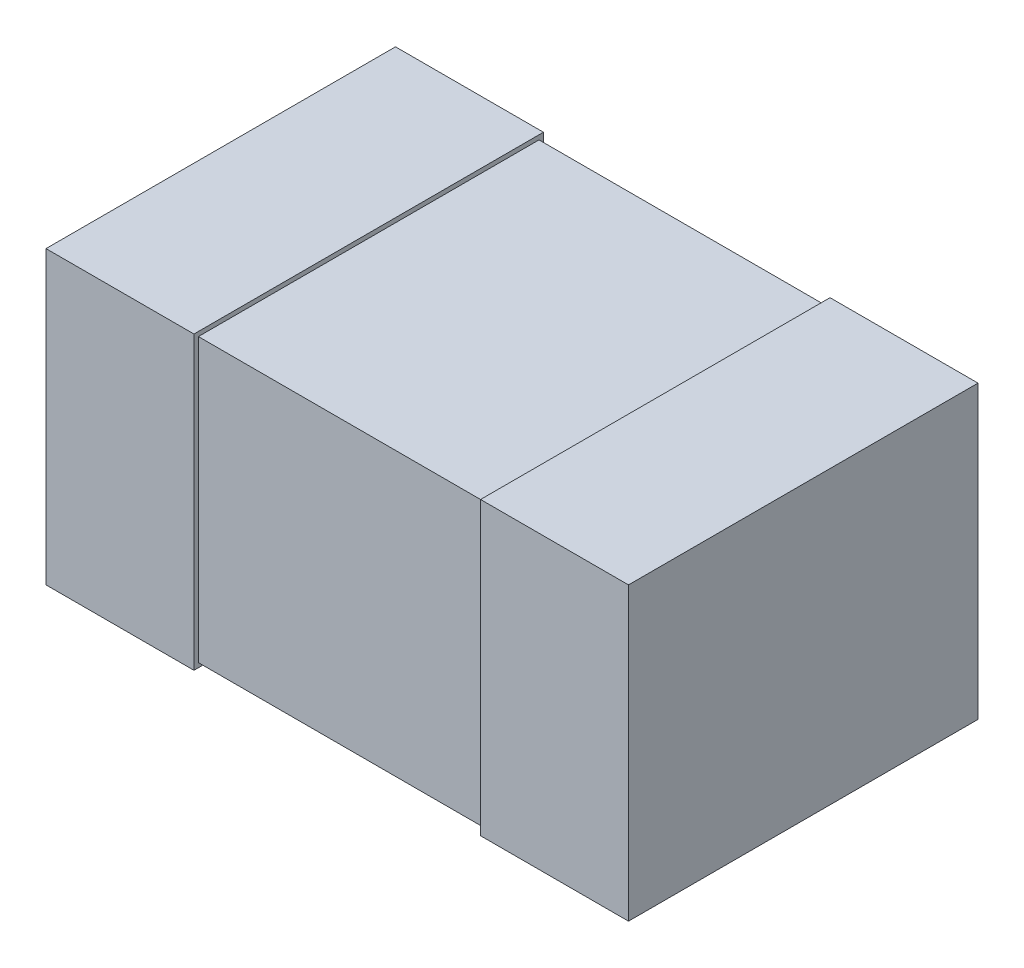
ISO-10303-21;
HEADER;
FILE_DESCRIPTION(('STEP AP214'),'2;1');
FILE_NAME('part.step','',(''),(''),'','','');
FILE_SCHEMA(('AUTOMOTIVE_DESIGN { 1 0 10303 214 1 1 1 1 }'));
ENDSEC;
DATA;
#1=APPLICATION_CONTEXT('core data for automotive mechanical design processes');
#2=APPLICATION_PROTOCOL_DEFINITION('international standard','automotive_design',2000,#1);
#3=PRODUCT_CONTEXT('',#1,'mechanical');
#4=PRODUCT('Part','Part','',(#3));
#5=PRODUCT_RELATED_PRODUCT_CATEGORY('part','',(#4));
#6=PRODUCT_DEFINITION_FORMATION('','',#4);
#7=PRODUCT_DEFINITION_CONTEXT('part definition',#1,'design');
#8=PRODUCT_DEFINITION('design','',#6,#7);
#9=PRODUCT_DEFINITION_SHAPE('','',#8);
#10=(LENGTH_UNIT() NAMED_UNIT(*) SI_UNIT(.MILLI.,.METRE.));
#11=(NAMED_UNIT(*) PLANE_ANGLE_UNIT() SI_UNIT($,.RADIAN.));
#12=(NAMED_UNIT(*) SI_UNIT($,.STERADIAN.) SOLID_ANGLE_UNIT());
#13=UNCERTAINTY_MEASURE_WITH_UNIT(LENGTH_MEASURE(1.E-05),#10,'distance_accuracy_value','');
#14=(GEOMETRIC_REPRESENTATION_CONTEXT(3) GLOBAL_UNCERTAINTY_ASSIGNED_CONTEXT((#13)) GLOBAL_UNIT_ASSIGNED_CONTEXT((#10,
#11,#12)) REPRESENTATION_CONTEXT('',''));
#15=CARTESIAN_POINT('',(0.,0.,0.));
#16=DIRECTION('',(0.,0.,1.));
#17=DIRECTION('',(1.,0.,0.));
#18=AXIS2_PLACEMENT_3D('',#15,#16,#17);
#19=CARTESIAN_POINT('',(0.5,-0.25,0.0762));
#20=DIRECTION('',(1.,0.,0.));
#21=DIRECTION('',(0.,0.,-1.));
#22=AXIS2_PLACEMENT_3D('',#19,#20,#21);
#23=PLANE('',#22);
#24=DIRECTION('',(0.,0.,-1.));
#25=VECTOR('',#24,1.);
#26=CARTESIAN_POINT('',(0.5,-0.25,0.0762));
#27=LINE('',#26,#25);
#28=CARTESIAN_POINT('',(0.5,-0.25,0.0762));
#29=VERTEX_POINT('',#28);
#30=CARTESIAN_POINT('',(0.5,-0.25,0.6762));
#31=VERTEX_POINT('',#30);
#32=EDGE_CURVE('E109',#29,#31,#27,.F.);
#33=ORIENTED_EDGE('',*,*,#32,.F.);
#34=DIRECTION('',(0.,1.,0.));
#35=VECTOR('',#34,1.);
#36=CARTESIAN_POINT('',(0.5,0.,0.0762));
#37=LINE('',#36,#35);
#38=CARTESIAN_POINT('',(0.5,0.25,0.0762));
#39=VERTEX_POINT('',#38);
#40=EDGE_CURVE('E20',#29,#39,#37,.T.);
#41=ORIENTED_EDGE('',*,*,#40,.T.);
#42=DIRECTION('',(0.,0.,1.));
#43=VECTOR('',#42,1.);
#44=CARTESIAN_POINT('',(0.5,0.25,0.0762));
#45=LINE('',#44,#43);
#46=CARTESIAN_POINT('',(0.5,0.25,0.6762));
#47=VERTEX_POINT('',#46);
#48=EDGE_CURVE('E104',#47,#39,#45,.F.);
#49=ORIENTED_EDGE('',*,*,#48,.F.);
#50=DIRECTION('',(0.,1.,0.));
#51=VECTOR('',#50,1.);
#52=CARTESIAN_POINT('',(0.5,0.,0.6762));
#53=LINE('',#52,#51);
#54=EDGE_CURVE('E119',#31,#47,#53,.T.);
#55=ORIENTED_EDGE('',*,*,#54,.F.);
#56=EDGE_LOOP('',(#33,#41,#49,#55));
#57=FACE_BOUND('',#56,.T.);
#58=ADVANCED_FACE('F17',(#57),#23,.T.);
#59=CARTESIAN_POINT('',(0.,0.,0.0762));
#60=DIRECTION('',(0.,0.,1.));
#61=DIRECTION('',(1.,0.,0.));
#62=AXIS2_PLACEMENT_3D('',#59,#60,#61);
#63=PLANE('',#62);
#64=ORIENTED_EDGE('',*,*,#40,.F.);
#65=DIRECTION('',(1.,0.,0.));
#66=VECTOR('',#65,1.);
#67=CARTESIAN_POINT('',(-0.5,-0.25,0.0762));
#68=LINE('',#67,#66);
#69=CARTESIAN_POINT('',(0.246,-0.25,0.0762));
#70=VERTEX_POINT('',#69);
#71=EDGE_CURVE('E128',#70,#29,#68,.T.);
#72=ORIENTED_EDGE('',*,*,#71,.F.);
#73=DIRECTION('',(0.,1.,0.));
#74=VECTOR('',#73,1.);
#75=CARTESIAN_POINT('',(0.246,-0.25,0.0762));
#76=LINE('',#75,#74);
#77=CARTESIAN_POINT('',(0.246,0.25,0.0762));
#78=VERTEX_POINT('',#77);
#79=EDGE_CURVE('E116',#70,#78,#76,.T.);
#80=ORIENTED_EDGE('',*,*,#79,.T.);
#81=DIRECTION('',(1.,0.,0.));
#82=VECTOR('',#81,1.);
#83=CARTESIAN_POINT('',(0.5,0.25,0.0762));
#84=LINE('',#83,#82);
#85=EDGE_CURVE('E113',#39,#78,#84,.F.);
#86=ORIENTED_EDGE('',*,*,#85,.F.);
#87=EDGE_LOOP('',(#64,#72,#80,#86));
#88=FACE_BOUND('',#87,.T.);
#89=ADVANCED_FACE('F114',(#88),#63,.F.);
#90=CARTESIAN_POINT('',(0.5,0.25,0.0762));
#91=DIRECTION('',(0.,1.,0.));
#92=DIRECTION('',(0.,0.,1.));
#93=AXIS2_PLACEMENT_3D('',#90,#91,#92);
#94=PLANE('',#93);
#95=ORIENTED_EDGE('',*,*,#85,.T.);
#96=DIRECTION('',(0.,0.,-1.));
#97=VECTOR('',#96,1.);
#98=CARTESIAN_POINT('',(0.246,0.25,0.08382));
#99=LINE('',#98,#97);
#100=CARTESIAN_POINT('',(0.246,0.25,0.6762));
#101=VERTEX_POINT('',#100);
#102=EDGE_CURVE('E135',#78,#101,#99,.F.);
#103=ORIENTED_EDGE('',*,*,#102,.T.);
#104=DIRECTION('',(1.,0.,0.));
#105=VECTOR('',#104,1.);
#106=CARTESIAN_POINT('',(0.,0.25,0.6762));
#107=LINE('',#106,#105);
#108=EDGE_CURVE('E123',#47,#101,#107,.F.);
#109=ORIENTED_EDGE('',*,*,#108,.F.);
#110=ORIENTED_EDGE('',*,*,#48,.T.);
#111=EDGE_LOOP('',(#95,#103,#109,#110));
#112=FACE_BOUND('',#111,.T.);
#113=ADVANCED_FACE('F121',(#112),#94,.T.);
#114=CARTESIAN_POINT('',(0.,0.,0.6762));
#115=DIRECTION('',(0.,0.,1.));
#116=DIRECTION('',(1.,0.,0.));
#117=AXIS2_PLACEMENT_3D('',#114,#115,#116);
#118=PLANE('',#117);
#119=ORIENTED_EDGE('',*,*,#108,.T.);
#120=DIRECTION('',(0.,1.,0.));
#121=VECTOR('',#120,1.);
#122=CARTESIAN_POINT('',(0.246,-0.25,0.6762));
#123=LINE('',#122,#121);
#124=CARTESIAN_POINT('',(0.246,-0.25,0.6762));
#125=VERTEX_POINT('',#124);
#126=EDGE_CURVE('E137',#101,#125,#123,.F.);
#127=ORIENTED_EDGE('',*,*,#126,.T.);
#128=DIRECTION('',(1.,0.,0.));
#129=VECTOR('',#128,1.);
#130=CARTESIAN_POINT('',(-0.5,-0.25,0.6762));
#131=LINE('',#130,#129);
#132=EDGE_CURVE('E131',#31,#125,#131,.F.);
#133=ORIENTED_EDGE('',*,*,#132,.F.);
#134=ORIENTED_EDGE('',*,*,#54,.T.);
#135=EDGE_LOOP('',(#119,#127,#133,#134));
#136=FACE_BOUND('',#135,.T.);
#137=ADVANCED_FACE('F327',(#136),#118,.T.);
#138=CARTESIAN_POINT('',(-0.5,-0.25,0.0762));
#139=DIRECTION('',(0.,-1.,0.));
#140=DIRECTION('',(0.,0.,-1.));
#141=AXIS2_PLACEMENT_3D('',#138,#139,#140);
#142=PLANE('',#141);
#143=ORIENTED_EDGE('',*,*,#132,.T.);
#144=DIRECTION('',(0.,0.,-1.));
#145=VECTOR('',#144,1.);
#146=CARTESIAN_POINT('',(0.246,-0.25,0.08382));
#147=LINE('',#146,#145);
#148=EDGE_CURVE('E139',#125,#70,#147,.T.);
#149=ORIENTED_EDGE('',*,*,#148,.T.);
#150=ORIENTED_EDGE('',*,*,#71,.T.);
#151=ORIENTED_EDGE('',*,*,#32,.T.);
#152=EDGE_LOOP('',(#143,#149,#150,#151));
#153=FACE_BOUND('',#152,.T.);
#154=ADVANCED_FACE('F318',(#153),#142,.T.);
#155=CARTESIAN_POINT('',(0.246,-0.25,0.08382));
#156=DIRECTION('',(1.,0.,0.));
#157=DIRECTION('',(0.,0.,-1.));
#158=AXIS2_PLACEMENT_3D('',#155,#156,#157);
#159=PLANE('',#158);
#160=DIRECTION('',(0.,1.,0.));
#161=VECTOR('',#160,1.);
#162=CARTESIAN_POINT('',(0.246,0.25,0.66858));
#163=LINE('',#162,#161);
#164=CARTESIAN_POINT('',(0.246,0.24238,0.66858));
#165=VERTEX_POINT('',#164);
#166=CARTESIAN_POINT('',(0.246,-0.24238,0.66858));
#167=VERTEX_POINT('',#166);
#168=EDGE_CURVE('E157',#165,#167,#163,.F.);
#169=ORIENTED_EDGE('',*,*,#168,.T.);
#170=DIRECTION('',(0.,0.,1.));
#171=VECTOR('',#170,1.);
#172=CARTESIAN_POINT('',(0.246,-0.24238,0.6762));
#173=LINE('',#172,#171);
#174=CARTESIAN_POINT('',(0.246,-0.24238,0.08382));
#175=VERTEX_POINT('',#174);
#176=EDGE_CURVE('E142',#167,#175,#173,.F.);
#177=ORIENTED_EDGE('',*,*,#176,.T.);
#178=DIRECTION('',(0.,1.,0.));
#179=VECTOR('',#178,1.);
#180=CARTESIAN_POINT('',(0.246,-0.25,0.08382));
#181=LINE('',#180,#179);
#182=CARTESIAN_POINT('',(0.246,0.24238,0.08382));
#183=VERTEX_POINT('',#182);
#184=EDGE_CURVE('E147',#175,#183,#181,.T.);
#185=ORIENTED_EDGE('',*,*,#184,.T.);
#186=DIRECTION('',(0.,0.,-1.));
#187=VECTOR('',#186,1.);
#188=CARTESIAN_POINT('',(0.246,0.24238,0.0762));
#189=LINE('',#188,#187);
#190=EDGE_CURVE('E152',#183,#165,#189,.F.);
#191=ORIENTED_EDGE('',*,*,#190,.T.);
#192=EDGE_LOOP('',(#169,#177,#185,#191));
#193=FACE_BOUND('',#192,.T.);
#194=ORIENTED_EDGE('',*,*,#126,.F.);
#195=ORIENTED_EDGE('',*,*,#102,.F.);
#196=ORIENTED_EDGE('',*,*,#79,.F.);
#197=ORIENTED_EDGE('',*,*,#148,.F.);
#198=EDGE_LOOP('',(#194,#195,#196,#197));
#199=FACE_BOUND('',#198,.T.);
#200=ADVANCED_FACE('F307',(#193,#199),#159,.F.);
#201=CARTESIAN_POINT('',(-0.246,-0.24238,0.6762));
#202=DIRECTION('',(0.,1.,0.));
#203=DIRECTION('',(0.,0.,1.));
#204=AXIS2_PLACEMENT_3D('',#201,#202,#203);
#205=PLANE('',#204);
#206=DIRECTION('',(1.,0.,0.));
#207=VECTOR('',#206,1.);
#208=CARTESIAN_POINT('',(-0.246,-0.24238,0.08382));
#209=LINE('',#208,#207);
#210=CARTESIAN_POINT('',(-0.246,-0.24238,0.08382));
#211=VERTEX_POINT('',#210);
#212=EDGE_CURVE('E144',#211,#175,#209,.T.);
#213=ORIENTED_EDGE('',*,*,#212,.T.);
#214=ORIENTED_EDGE('',*,*,#176,.F.);
#215=DIRECTION('',(-1.,0.,0.));
#216=VECTOR('',#215,1.);
#217=CARTESIAN_POINT('',(-0.246,-0.24238,0.66858));
#218=LINE('',#217,#216);
#219=CARTESIAN_POINT('',(-0.246,-0.24238,0.66858));
#220=VERTEX_POINT('',#219);
#221=EDGE_CURVE('E159',#167,#220,#218,.T.);
#222=ORIENTED_EDGE('',*,*,#221,.T.);
#223=DIRECTION('',(0.,0.,1.));
#224=VECTOR('',#223,1.);
#225=CARTESIAN_POINT('',(-0.246,-0.24238,0.0762));
#226=LINE('',#225,#224);
#227=EDGE_CURVE('E161',#220,#211,#226,.F.);
#228=ORIENTED_EDGE('',*,*,#227,.T.);
#229=EDGE_LOOP('',(#213,#214,#222,#228));
#230=FACE_BOUND('',#229,.T.);
#231=ADVANCED_FACE('F297',(#230),#205,.F.);
#232=CARTESIAN_POINT('',(-0.246,-0.25,0.08382));
#233=DIRECTION('',(0.,0.,1.));
#234=DIRECTION('',(1.,0.,0.));
#235=AXIS2_PLACEMENT_3D('',#232,#233,#234);
#236=PLANE('',#235);
#237=DIRECTION('',(1.,0.,0.));
#238=VECTOR('',#237,1.);
#239=CARTESIAN_POINT('',(-0.246,0.24238,0.08382));
#240=LINE('',#239,#238);
#241=CARTESIAN_POINT('',(-0.246,0.24238,0.08382));
#242=VERTEX_POINT('',#241);
#243=EDGE_CURVE('E149',#242,#183,#240,.T.);
#244=ORIENTED_EDGE('',*,*,#243,.T.);
#245=ORIENTED_EDGE('',*,*,#184,.F.);
#246=ORIENTED_EDGE('',*,*,#212,.F.);
#247=DIRECTION('',(0.,1.,0.));
#248=VECTOR('',#247,1.);
#249=CARTESIAN_POINT('',(-0.246,-0.25,0.08382));
#250=LINE('',#249,#248);
#251=EDGE_CURVE('E163',#211,#242,#250,.T.);
#252=ORIENTED_EDGE('',*,*,#251,.T.);
#253=EDGE_LOOP('',(#244,#245,#246,#252));
#254=FACE_BOUND('',#253,.T.);
#255=ADVANCED_FACE('F287',(#254),#236,.F.);
#256=CARTESIAN_POINT('',(-0.246,0.24238,0.0762));
#257=DIRECTION('',(0.,-1.,0.));
#258=DIRECTION('',(0.,0.,-1.));
#259=AXIS2_PLACEMENT_3D('',#256,#257,#258);
#260=PLANE('',#259);
#261=DIRECTION('',(-1.,0.,0.));
#262=VECTOR('',#261,1.);
#263=CARTESIAN_POINT('',(-0.246,0.24238,0.66858));
#264=LINE('',#263,#262);
#265=CARTESIAN_POINT('',(-0.246,0.24238,0.66858));
#266=VERTEX_POINT('',#265);
#267=EDGE_CURVE('E154',#266,#165,#264,.F.);
#268=ORIENTED_EDGE('',*,*,#267,.T.);
#269=ORIENTED_EDGE('',*,*,#190,.F.);
#270=ORIENTED_EDGE('',*,*,#243,.F.);
#271=DIRECTION('',(0.,0.,1.));
#272=VECTOR('',#271,1.);
#273=CARTESIAN_POINT('',(-0.246,0.24238,0.0762));
#274=LINE('',#273,#272);
#275=EDGE_CURVE('E165',#242,#266,#274,.T.);
#276=ORIENTED_EDGE('',*,*,#275,.T.);
#277=EDGE_LOOP('',(#268,#269,#270,#276));
#278=FACE_BOUND('',#277,.T.);
#279=ADVANCED_FACE('F278',(#278),#260,.F.);
#280=CARTESIAN_POINT('',(-0.246,0.25,0.66858));
#281=DIRECTION('',(0.,0.,-1.));
#282=DIRECTION('',(-1.,0.,0.));
#283=AXIS2_PLACEMENT_3D('',#280,#281,#282);
#284=PLANE('',#283);
#285=ORIENTED_EDGE('',*,*,#221,.F.);
#286=ORIENTED_EDGE('',*,*,#168,.F.);
#287=ORIENTED_EDGE('',*,*,#267,.F.);
#288=DIRECTION('',(0.,1.,0.));
#289=VECTOR('',#288,1.);
#290=CARTESIAN_POINT('',(-0.246,-0.25,0.66858));
#291=LINE('',#290,#289);
#292=EDGE_CURVE('E167',#266,#220,#291,.F.);
#293=ORIENTED_EDGE('',*,*,#292,.T.);
#294=EDGE_LOOP('',(#285,#286,#287,#293));
#295=FACE_BOUND('',#294,.T.);
#296=ADVANCED_FACE('F219',(#295),#284,.F.);
#297=CARTESIAN_POINT('',(-0.246,-0.25,0.0762));
#298=DIRECTION('',(-1.,0.,0.));
#299=DIRECTION('',(0.,0.,1.));
#300=AXIS2_PLACEMENT_3D('',#297,#298,#299);
#301=PLANE('',#300);
#302=ORIENTED_EDGE('',*,*,#275,.F.);
#303=ORIENTED_EDGE('',*,*,#251,.F.);
#304=ORIENTED_EDGE('',*,*,#227,.F.);
#305=ORIENTED_EDGE('',*,*,#292,.F.);
#306=EDGE_LOOP('',(#302,#303,#304,#305));
#307=FACE_BOUND('',#306,.T.);
#308=DIRECTION('',(0.,1.,0.));
#309=VECTOR('',#308,1.);
#310=CARTESIAN_POINT('',(-0.246,0.,0.6762));
#311=LINE('',#310,#309);
#312=CARTESIAN_POINT('',(-0.246,-0.25,0.6762));
#313=VERTEX_POINT('',#312);
#314=CARTESIAN_POINT('',(-0.246,0.25,0.6762));
#315=VERTEX_POINT('',#314);
#316=EDGE_CURVE('E175',#313,#315,#311,.T.);
#317=ORIENTED_EDGE('',*,*,#316,.F.);
#318=DIRECTION('',(0.,0.,-1.));
#319=VECTOR('',#318,1.);
#320=CARTESIAN_POINT('',(-0.246,-0.25,0.0762));
#321=LINE('',#320,#319);
#322=CARTESIAN_POINT('',(-0.246,-0.25,0.0762));
#323=VERTEX_POINT('',#322);
#324=EDGE_CURVE('E170',#323,#313,#321,.F.);
#325=ORIENTED_EDGE('',*,*,#324,.F.);
#326=DIRECTION('',(0.,1.,0.));
#327=VECTOR('',#326,1.);
#328=CARTESIAN_POINT('',(-0.246,0.,0.0762));
#329=LINE('',#328,#327);
#330=CARTESIAN_POINT('',(-0.246,0.25,0.0762));
#331=VERTEX_POINT('',#330);
#332=EDGE_CURVE('E182',#323,#331,#329,.T.);
#333=ORIENTED_EDGE('',*,*,#332,.T.);
#334=DIRECTION('',(0.,0.,1.));
#335=VECTOR('',#334,1.);
#336=CARTESIAN_POINT('',(-0.246,0.25,0.0762));
#337=LINE('',#336,#335);
#338=EDGE_CURVE('E180',#315,#331,#337,.F.);
#339=ORIENTED_EDGE('',*,*,#338,.F.);
#340=EDGE_LOOP('',(#317,#325,#333,#339));
#341=FACE_BOUND('',#340,.T.);
#342=ADVANCED_FACE('F204',(#307,#341),#301,.F.);
#343=CARTESIAN_POINT('',(-0.5,-0.25,0.0762));
#344=DIRECTION('',(0.,-1.,0.));
#345=DIRECTION('',(0.,0.,-1.));
#346=AXIS2_PLACEMENT_3D('',#343,#344,#345);
#347=PLANE('',#346);
#348=DIRECTION('',(1.,0.,0.));
#349=VECTOR('',#348,1.);
#350=CARTESIAN_POINT('',(0.,-0.25,0.0762));
#351=LINE('',#350,#349);
#352=CARTESIAN_POINT('',(-0.5,-0.25,0.0762));
#353=VERTEX_POINT('',#352);
#354=EDGE_CURVE('E185',#353,#323,#351,.T.);
#355=ORIENTED_EDGE('',*,*,#354,.T.);
#356=ORIENTED_EDGE('',*,*,#324,.T.);
#357=DIRECTION('',(1.,0.,0.));
#358=VECTOR('',#357,1.);
#359=CARTESIAN_POINT('',(0.,-0.25,0.6762));
#360=LINE('',#359,#358);
#361=CARTESIAN_POINT('',(-0.5,-0.25,0.6762));
#362=VERTEX_POINT('',#361);
#363=EDGE_CURVE('E172',#362,#313,#360,.T.);
#364=ORIENTED_EDGE('',*,*,#363,.F.);
#365=DIRECTION('',(0.,0.,1.));
#366=VECTOR('',#365,1.);
#367=CARTESIAN_POINT('',(-0.5,-0.25,0.0762));
#368=LINE('',#367,#366);
#369=EDGE_CURVE('E188',#353,#362,#368,.T.);
#370=ORIENTED_EDGE('',*,*,#369,.F.);
#371=EDGE_LOOP('',(#355,#356,#364,#370));
#372=FACE_BOUND('',#371,.T.);
#373=ADVANCED_FACE('F210',(#372),#347,.T.);
#374=CARTESIAN_POINT('',(0.,0.,0.6762));
#375=DIRECTION('',(0.,0.,1.));
#376=DIRECTION('',(1.,0.,0.));
#377=AXIS2_PLACEMENT_3D('',#374,#375,#376);
#378=PLANE('',#377);
#379=ORIENTED_EDGE('',*,*,#363,.T.);
#380=ORIENTED_EDGE('',*,*,#316,.T.);
#381=DIRECTION('',(1.,0.,0.));
#382=VECTOR('',#381,1.);
#383=CARTESIAN_POINT('',(0.5,0.25,0.6762));
#384=LINE('',#383,#382);
#385=CARTESIAN_POINT('',(-0.5,0.25,0.6762));
#386=VERTEX_POINT('',#385);
#387=EDGE_CURVE('E177',#386,#315,#384,.T.);
#388=ORIENTED_EDGE('',*,*,#387,.F.);
#389=DIRECTION('',(0.,1.,0.));
#390=VECTOR('',#389,1.);
#391=CARTESIAN_POINT('',(-0.5,0.25,0.6762));
#392=LINE('',#391,#390);
#393=EDGE_CURVE('E191',#362,#386,#392,.T.);
#394=ORIENTED_EDGE('',*,*,#393,.F.);
#395=EDGE_LOOP('',(#379,#380,#388,#394));
#396=FACE_BOUND('',#395,.T.);
#397=ADVANCED_FACE('F201',(#396),#378,.T.);
#398=CARTESIAN_POINT('',(0.5,0.25,0.0762));
#399=DIRECTION('',(0.,1.,0.));
#400=DIRECTION('',(0.,0.,1.));
#401=AXIS2_PLACEMENT_3D('',#398,#399,#400);
#402=PLANE('',#401);
#403=ORIENTED_EDGE('',*,*,#387,.T.);
#404=ORIENTED_EDGE('',*,*,#338,.T.);
#405=DIRECTION('',(1.,0.,0.));
#406=VECTOR('',#405,1.);
#407=CARTESIAN_POINT('',(0.,0.25,0.0762));
#408=LINE('',#407,#406);
#409=CARTESIAN_POINT('',(-0.5,0.25,0.0762));
#410=VERTEX_POINT('',#409);
#411=EDGE_CURVE('E35',#331,#410,#408,.F.);
#412=ORIENTED_EDGE('',*,*,#411,.T.);
#413=DIRECTION('',(0.,0.,1.));
#414=VECTOR('',#413,1.);
#415=CARTESIAN_POINT('',(-0.5,0.25,0.0762));
#416=LINE('',#415,#414);
#417=EDGE_CURVE('E26',#386,#410,#416,.F.);
#418=ORIENTED_EDGE('',*,*,#417,.F.);
#419=EDGE_LOOP('',(#403,#404,#412,#418));
#420=FACE_BOUND('',#419,.T.);
#421=ADVANCED_FACE('F198',(#420),#402,.T.);
#422=CARTESIAN_POINT('',(0.,0.,0.0762));
#423=DIRECTION('',(0.,0.,1.));
#424=DIRECTION('',(1.,0.,0.));
#425=AXIS2_PLACEMENT_3D('',#422,#423,#424);
#426=PLANE('',#425);
#427=DIRECTION('',(0.,1.,0.));
#428=VECTOR('',#427,1.);
#429=CARTESIAN_POINT('',(-0.5,0.25,0.0762));
#430=LINE('',#429,#428);
#431=EDGE_CURVE('E11',#410,#353,#430,.F.);
#432=ORIENTED_EDGE('',*,*,#431,.F.);
#433=ORIENTED_EDGE('',*,*,#411,.F.);
#434=ORIENTED_EDGE('',*,*,#332,.F.);
#435=ORIENTED_EDGE('',*,*,#354,.F.);
#436=EDGE_LOOP('',(#432,#433,#434,#435));
#437=FACE_BOUND('',#436,.T.);
#438=ADVANCED_FACE('F208',(#437),#426,.F.);
#439=CARTESIAN_POINT('',(-0.5,0.25,0.0762));
#440=DIRECTION('',(-1.,0.,0.));
#441=DIRECTION('',(0.,0.,1.));
#442=AXIS2_PLACEMENT_3D('',#439,#440,#441);
#443=PLANE('',#442);
#444=ORIENTED_EDGE('',*,*,#417,.T.);
#445=ORIENTED_EDGE('',*,*,#431,.T.);
#446=ORIENTED_EDGE('',*,*,#369,.T.);
#447=ORIENTED_EDGE('',*,*,#393,.T.);
#448=EDGE_LOOP('',(#444,#445,#446,#447));
#449=FACE_BOUND('',#448,.T.);
#450=ADVANCED_FACE('F196',(#449),#443,.T.);
#451=CLOSED_SHELL('',(#58,#89,#113,#137,#154,#200,#231,#255,#279,#296,#342,#373,#397,#421,#438,#450));
#452=MANIFOLD_SOLID_BREP('B1',#451);
#453=ADVANCED_BREP_SHAPE_REPRESENTATION('',(#18,#452),#14);
#454=SHAPE_DEFINITION_REPRESENTATION(#9,#453);
ENDSEC;
END-ISO-10303-21;
